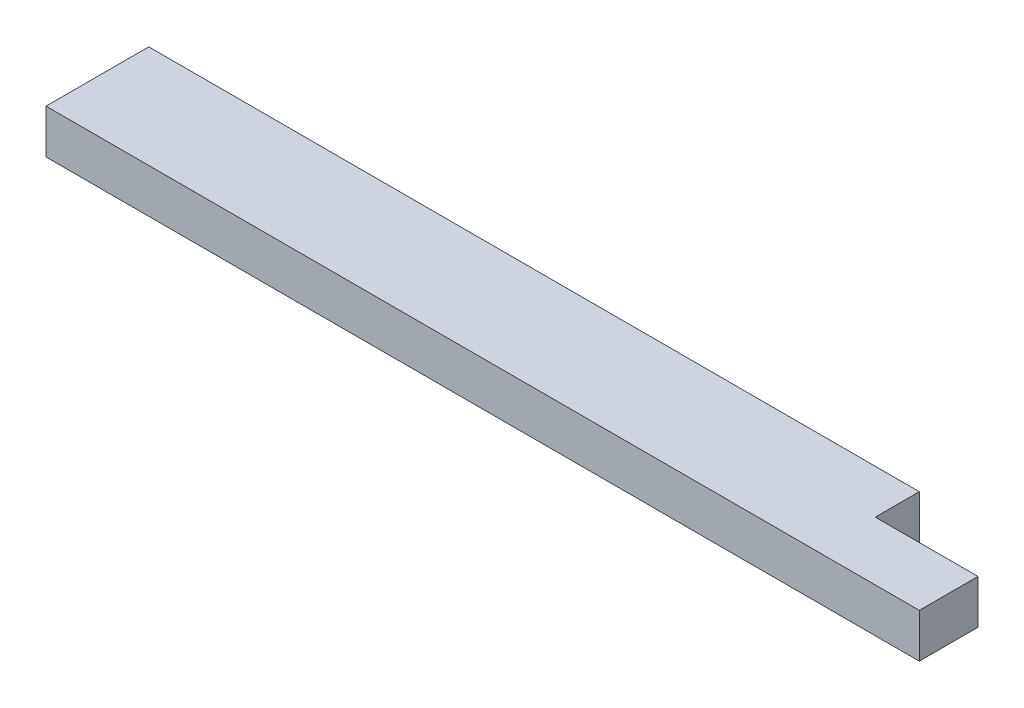
ISO-10303-21;
HEADER;
FILE_DESCRIPTION(('STEP AP214'),'2;1');
FILE_NAME('part.step','',(''),(''),'','','');
FILE_SCHEMA(('AUTOMOTIVE_DESIGN { 1 0 10303 214 1 1 1 1 }'));
ENDSEC;
DATA;
#1=APPLICATION_CONTEXT('core data for automotive mechanical design processes');
#2=APPLICATION_PROTOCOL_DEFINITION('international standard','automotive_design',2000,#1);
#3=PRODUCT_CONTEXT('',#1,'mechanical');
#4=PRODUCT('Part','Part','',(#3));
#5=PRODUCT_RELATED_PRODUCT_CATEGORY('part','',(#4));
#6=PRODUCT_DEFINITION_FORMATION('','',#4);
#7=PRODUCT_DEFINITION_CONTEXT('part definition',#1,'design');
#8=PRODUCT_DEFINITION('design','',#6,#7);
#9=PRODUCT_DEFINITION_SHAPE('','',#8);
#10=(LENGTH_UNIT() NAMED_UNIT(*) SI_UNIT(.MILLI.,.METRE.));
#11=(NAMED_UNIT(*) PLANE_ANGLE_UNIT() SI_UNIT($,.RADIAN.));
#12=(NAMED_UNIT(*) SI_UNIT($,.STERADIAN.) SOLID_ANGLE_UNIT());
#13=UNCERTAINTY_MEASURE_WITH_UNIT(LENGTH_MEASURE(1.E-05),#10,'distance_accuracy_value','');
#14=(GEOMETRIC_REPRESENTATION_CONTEXT(3) GLOBAL_UNCERTAINTY_ASSIGNED_CONTEXT((#13)) GLOBAL_UNIT_ASSIGNED_CONTEXT((#10,
#11,#12)) REPRESENTATION_CONTEXT('',''));
#15=CARTESIAN_POINT('',(0.,0.,0.));
#16=DIRECTION('',(0.,0.,1.));
#17=DIRECTION('',(1.,0.,0.));
#18=AXIS2_PLACEMENT_3D('',#15,#16,#17);
#19=CARTESIAN_POINT('',(0.,38.1,0.));
#20=DIRECTION('',(1.,0.,0.));
#21=DIRECTION('',(0.,0.,-1.));
#22=AXIS2_PLACEMENT_3D('',#19,#20,#21);
#23=PLANE('',#22);
#24=DIRECTION('',(0.,0.,1.));
#25=VECTOR('',#24,1.);
#26=CARTESIAN_POINT('',(0.,0.,0.));
#27=LINE('',#26,#25);
#28=CARTESIAN_POINT('',(0.,0.,-88.9));
#29=VERTEX_POINT('',#28);
#30=CARTESIAN_POINT('',(0.,0.,0.));
#31=VERTEX_POINT('',#30);
#32=EDGE_CURVE('E127',#29,#31,#27,.T.);
#33=ORIENTED_EDGE('',*,*,#32,.T.);
#34=DIRECTION('',(0.,-1.,0.));
#35=VECTOR('',#34,1.);
#36=CARTESIAN_POINT('',(0.,38.1,0.));
#37=LINE('',#36,#35);
#38=CARTESIAN_POINT('',(0.,38.1,0.));
#39=VERTEX_POINT('',#38);
#40=EDGE_CURVE('E11',#39,#31,#37,.T.);
#41=ORIENTED_EDGE('',*,*,#40,.F.);
#42=DIRECTION('',(0.,0.,1.));
#43=VECTOR('',#42,1.);
#44=CARTESIAN_POINT('',(0.,38.1,0.));
#45=LINE('',#44,#43);
#46=CARTESIAN_POINT('',(0.,38.1,-88.9));
#47=VERTEX_POINT('',#46);
#48=EDGE_CURVE('E123',#47,#39,#45,.T.);
#49=ORIENTED_EDGE('',*,*,#48,.F.);
#50=DIRECTION('',(0.,-1.,0.));
#51=VECTOR('',#50,1.);
#52=CARTESIAN_POINT('',(0.,38.1,-88.9));
#53=LINE('',#52,#51);
#54=EDGE_CURVE('E121',#47,#29,#53,.T.);
#55=ORIENTED_EDGE('',*,*,#54,.T.);
#56=EDGE_LOOP('',(#33,#41,#49,#55));
#57=FACE_BOUND('',#56,.T.);
#58=ADVANCED_FACE('F41',(#57),#23,.F.);
#59=CARTESIAN_POINT('',(0.,38.1,0.));
#60=DIRECTION('',(0.,0.,-1.));
#61=DIRECTION('',(-1.,0.,0.));
#62=AXIS2_PLACEMENT_3D('',#59,#60,#61);
#63=PLANE('',#62);
#64=DIRECTION('',(1.,0.,0.));
#65=VECTOR('',#64,1.);
#66=CARTESIAN_POINT('',(0.,0.,0.));
#67=LINE('',#66,#65);
#68=CARTESIAN_POINT('',(755.65,0.,0.));
#69=VERTEX_POINT('',#68);
#70=EDGE_CURVE('E130',#31,#69,#67,.T.);
#71=ORIENTED_EDGE('',*,*,#70,.T.);
#72=DIRECTION('',(0.,-1.,0.));
#73=VECTOR('',#72,1.);
#74=CARTESIAN_POINT('',(755.65,38.1,0.));
#75=LINE('',#74,#73);
#76=CARTESIAN_POINT('',(755.65,38.1,0.));
#77=VERTEX_POINT('',#76);
#78=EDGE_CURVE('E48',#77,#69,#75,.T.);
#79=ORIENTED_EDGE('',*,*,#78,.F.);
#80=DIRECTION('',(1.,0.,0.));
#81=VECTOR('',#80,1.);
#82=CARTESIAN_POINT('',(0.,38.1,0.));
#83=LINE('',#82,#81);
#84=EDGE_CURVE('E87',#39,#77,#83,.T.);
#85=ORIENTED_EDGE('',*,*,#84,.F.);
#86=ORIENTED_EDGE('',*,*,#40,.T.);
#87=EDGE_LOOP('',(#71,#79,#85,#86));
#88=FACE_BOUND('',#87,.T.);
#89=ADVANCED_FACE('F148',(#88),#63,.F.);
#90=CARTESIAN_POINT('',(755.65,38.1,0.));
#91=DIRECTION('',(-1.,0.,0.));
#92=DIRECTION('',(0.,0.,1.));
#93=AXIS2_PLACEMENT_3D('',#90,#91,#92);
#94=PLANE('',#93);
#95=DIRECTION('',(0.,0.,-1.));
#96=VECTOR('',#95,1.);
#97=CARTESIAN_POINT('',(755.65,0.,0.));
#98=LINE('',#97,#96);
#99=CARTESIAN_POINT('',(755.65,0.,-50.8));
#100=VERTEX_POINT('',#99);
#101=EDGE_CURVE('E117',#69,#100,#98,.T.);
#102=ORIENTED_EDGE('',*,*,#101,.T.);
#103=DIRECTION('',(0.,-1.,0.));
#104=VECTOR('',#103,1.);
#105=CARTESIAN_POINT('',(755.65,38.1,-50.8));
#106=LINE('',#105,#104);
#107=CARTESIAN_POINT('',(755.65,38.1,-50.8));
#108=VERTEX_POINT('',#107);
#109=EDGE_CURVE('E55',#108,#100,#106,.T.);
#110=ORIENTED_EDGE('',*,*,#109,.F.);
#111=DIRECTION('',(0.,0.,-1.));
#112=VECTOR('',#111,1.);
#113=CARTESIAN_POINT('',(755.65,38.1,0.));
#114=LINE('',#113,#112);
#115=EDGE_CURVE('E115',#77,#108,#114,.T.);
#116=ORIENTED_EDGE('',*,*,#115,.F.);
#117=ORIENTED_EDGE('',*,*,#78,.T.);
#118=EDGE_LOOP('',(#102,#110,#116,#117));
#119=FACE_BOUND('',#118,.T.);
#120=ADVANCED_FACE('F113',(#119),#94,.F.);
#121=CARTESIAN_POINT('',(0.,38.1,-88.9));
#122=DIRECTION('',(0.,0.,1.));
#123=DIRECTION('',(1.,0.,0.));
#124=AXIS2_PLACEMENT_3D('',#121,#122,#123);
#125=PLANE('',#124);
#126=DIRECTION('',(-1.,0.,0.));
#127=VECTOR('',#126,1.);
#128=CARTESIAN_POINT('',(0.,38.1,-88.9));
#129=LINE('',#128,#127);
#130=CARTESIAN_POINT('',(666.75,38.1,-88.9));
#131=VERTEX_POINT('',#130);
#132=EDGE_CURVE('E64',#131,#47,#129,.T.);
#133=ORIENTED_EDGE('',*,*,#132,.F.);
#134=DIRECTION('',(0.,-1.,0.));
#135=VECTOR('',#134,1.);
#136=CARTESIAN_POINT('',(666.75,38.1,-88.9));
#137=LINE('',#136,#135);
#138=CARTESIAN_POINT('',(666.75,0.,-88.9));
#139=VERTEX_POINT('',#138);
#140=EDGE_CURVE('E131',#131,#139,#137,.T.);
#141=ORIENTED_EDGE('',*,*,#140,.T.);
#142=DIRECTION('',(-1.,0.,0.));
#143=VECTOR('',#142,1.);
#144=CARTESIAN_POINT('',(0.,0.,-88.9));
#145=LINE('',#144,#143);
#146=EDGE_CURVE('E82',#139,#29,#145,.T.);
#147=ORIENTED_EDGE('',*,*,#146,.T.);
#148=ORIENTED_EDGE('',*,*,#54,.F.);
#149=EDGE_LOOP('',(#133,#141,#147,#148));
#150=FACE_BOUND('',#149,.T.);
#151=ADVANCED_FACE('F154',(#150),#125,.F.);
#152=CARTESIAN_POINT('',(0.,38.1,0.));
#153=DIRECTION('',(0.,-1.,0.));
#154=DIRECTION('',(0.,0.,-1.));
#155=AXIS2_PLACEMENT_3D('',#152,#153,#154);
#156=PLANE('',#155);
#157=DIRECTION('',(-1.,0.,0.));
#158=VECTOR('',#157,1.);
#159=CARTESIAN_POINT('',(755.65,38.1,-50.8));
#160=LINE('',#159,#158);
#161=CARTESIAN_POINT('',(666.75,38.1,-50.8));
#162=VERTEX_POINT('',#161);
#163=EDGE_CURVE('E102',#108,#162,#160,.T.);
#164=ORIENTED_EDGE('',*,*,#163,.T.);
#165=DIRECTION('',(0.,0.,-1.));
#166=VECTOR('',#165,1.);
#167=CARTESIAN_POINT('',(666.75,38.1,-88.9));
#168=LINE('',#167,#166);
#169=EDGE_CURVE('E107',#162,#131,#168,.T.);
#170=ORIENTED_EDGE('',*,*,#169,.T.);
#171=ORIENTED_EDGE('',*,*,#132,.T.);
#172=ORIENTED_EDGE('',*,*,#48,.T.);
#173=ORIENTED_EDGE('',*,*,#84,.T.);
#174=ORIENTED_EDGE('',*,*,#115,.T.);
#175=EDGE_LOOP('',(#164,#170,#171,#172,#173,#174));
#176=FACE_BOUND('',#175,.T.);
#177=ADVANCED_FACE('F119',(#176),#156,.F.);
#178=CARTESIAN_POINT('',(0.,0.,0.));
#179=DIRECTION('',(0.,-1.,0.));
#180=DIRECTION('',(0.,0.,-1.));
#181=AXIS2_PLACEMENT_3D('',#178,#179,#180);
#182=PLANE('',#181);
#183=DIRECTION('',(0.,0.,-1.));
#184=VECTOR('',#183,1.);
#185=CARTESIAN_POINT('',(666.75,0.,-88.9));
#186=LINE('',#185,#184);
#187=CARTESIAN_POINT('',(666.75,0.,-50.8));
#188=VERTEX_POINT('',#187);
#189=EDGE_CURVE('E108',#188,#139,#186,.T.);
#190=ORIENTED_EDGE('',*,*,#189,.F.);
#191=DIRECTION('',(-1.,0.,0.));
#192=VECTOR('',#191,1.);
#193=CARTESIAN_POINT('',(755.65,0.,-50.8));
#194=LINE('',#193,#192);
#195=EDGE_CURVE('E139',#100,#188,#194,.T.);
#196=ORIENTED_EDGE('',*,*,#195,.F.);
#197=ORIENTED_EDGE('',*,*,#101,.F.);
#198=ORIENTED_EDGE('',*,*,#70,.F.);
#199=ORIENTED_EDGE('',*,*,#32,.F.);
#200=ORIENTED_EDGE('',*,*,#146,.F.);
#201=EDGE_LOOP('',(#190,#196,#197,#198,#199,#200));
#202=FACE_BOUND('',#201,.T.);
#203=ADVANCED_FACE('F137',(#202),#182,.T.);
#204=CARTESIAN_POINT('',(666.75,38.1,-88.9));
#205=DIRECTION('',(-1.,0.,0.));
#206=DIRECTION('',(0.,0.,1.));
#207=AXIS2_PLACEMENT_3D('',#204,#205,#206);
#208=PLANE('',#207);
#209=ORIENTED_EDGE('',*,*,#189,.T.);
#210=ORIENTED_EDGE('',*,*,#140,.F.);
#211=ORIENTED_EDGE('',*,*,#169,.F.);
#212=DIRECTION('',(0.,-1.,0.));
#213=VECTOR('',#212,1.);
#214=CARTESIAN_POINT('',(666.75,38.1,-50.8));
#215=LINE('',#214,#213);
#216=EDGE_CURVE('E104',#162,#188,#215,.T.);
#217=ORIENTED_EDGE('',*,*,#216,.T.);
#218=EDGE_LOOP('',(#209,#210,#211,#217));
#219=FACE_BOUND('',#218,.T.);
#220=ADVANCED_FACE('F161',(#219),#208,.F.);
#221=CARTESIAN_POINT('',(755.65,38.1,-50.8));
#222=DIRECTION('',(0.,0.,1.));
#223=DIRECTION('',(1.,0.,0.));
#224=AXIS2_PLACEMENT_3D('',#221,#222,#223);
#225=PLANE('',#224);
#226=ORIENTED_EDGE('',*,*,#195,.T.);
#227=ORIENTED_EDGE('',*,*,#216,.F.);
#228=ORIENTED_EDGE('',*,*,#163,.F.);
#229=ORIENTED_EDGE('',*,*,#109,.T.);
#230=EDGE_LOOP('',(#226,#227,#228,#229));
#231=FACE_BOUND('',#230,.T.);
#232=ADVANCED_FACE('F103',(#231),#225,.F.);
#233=CLOSED_SHELL('',(#58,#89,#120,#151,#177,#203,#220,#232));
#234=MANIFOLD_SOLID_BREP('B2',#233);
#235=ADVANCED_BREP_SHAPE_REPRESENTATION('',(#18,#234),#14);
#236=SHAPE_DEFINITION_REPRESENTATION(#9,#235);
ENDSEC;
END-ISO-10303-21;
